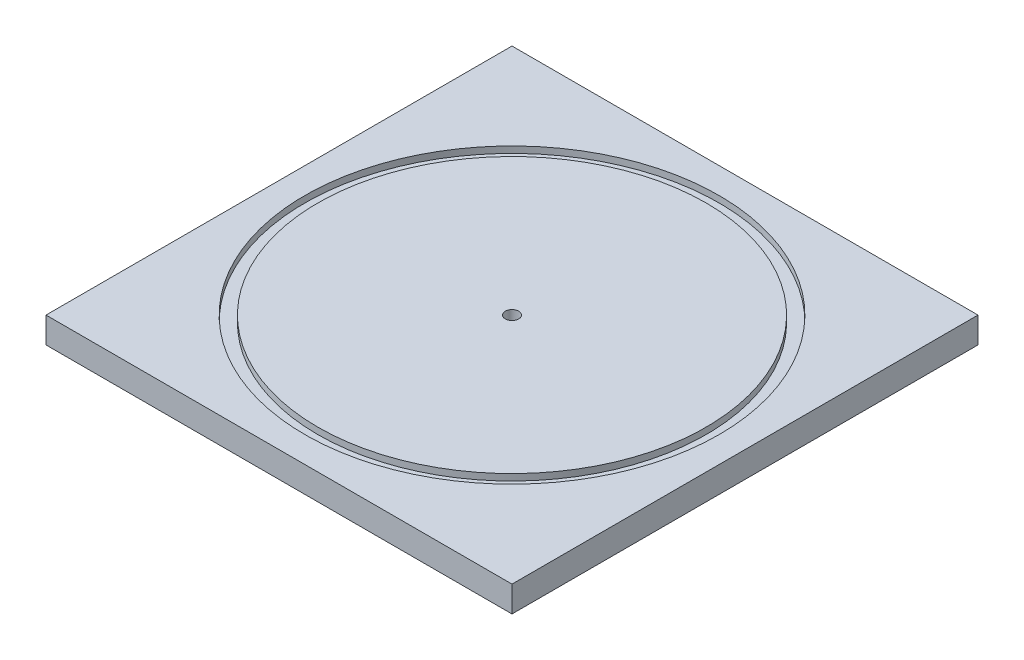
ISO-10303-21;
HEADER;
FILE_DESCRIPTION(('STEP AP214'),'2;1');
FILE_NAME('part.step','',(''),(''),'','','');
FILE_SCHEMA(('AUTOMOTIVE_DESIGN { 1 0 10303 214 1 1 1 1 }'));
ENDSEC;
DATA;
#1=APPLICATION_CONTEXT('core data for automotive mechanical design processes');
#2=APPLICATION_PROTOCOL_DEFINITION('international standard','automotive_design',2000,#1);
#3=PRODUCT_CONTEXT('',#1,'mechanical');
#4=PRODUCT('Part','Part','',(#3));
#5=PRODUCT_RELATED_PRODUCT_CATEGORY('part','',(#4));
#6=PRODUCT_DEFINITION_FORMATION('','',#4);
#7=PRODUCT_DEFINITION_CONTEXT('part definition',#1,'design');
#8=PRODUCT_DEFINITION('design','',#6,#7);
#9=PRODUCT_DEFINITION_SHAPE('','',#8);
#10=(LENGTH_UNIT() NAMED_UNIT(*) SI_UNIT(.MILLI.,.METRE.));
#11=(NAMED_UNIT(*) PLANE_ANGLE_UNIT() SI_UNIT($,.RADIAN.));
#12=(NAMED_UNIT(*) SI_UNIT($,.STERADIAN.) SOLID_ANGLE_UNIT());
#13=UNCERTAINTY_MEASURE_WITH_UNIT(LENGTH_MEASURE(1.E-05),#10,'distance_accuracy_value','');
#14=(GEOMETRIC_REPRESENTATION_CONTEXT(3) GLOBAL_UNCERTAINTY_ASSIGNED_CONTEXT((#13)) GLOBAL_UNIT_ASSIGNED_CONTEXT((#10,
#11,#12)) REPRESENTATION_CONTEXT('',''));
#15=CARTESIAN_POINT('',(0.,0.,0.));
#16=DIRECTION('',(0.,0.,1.));
#17=DIRECTION('',(1.,0.,0.));
#18=AXIS2_PLACEMENT_3D('',#15,#16,#17);
#19=CARTESIAN_POINT('',(-57.15,6.35,57.15));
#20=DIRECTION('',(1.,0.,0.));
#21=DIRECTION('',(0.,0.,-1.));
#22=AXIS2_PLACEMENT_3D('',#19,#20,#21);
#23=PLANE('',#22);
#24=DIRECTION('',(0.,0.,1.));
#25=VECTOR('',#24,1.);
#26=CARTESIAN_POINT('',(-57.15,0.,57.15));
#27=LINE('',#26,#25);
#28=CARTESIAN_POINT('',(-57.15,0.,-57.15));
#29=VERTEX_POINT('',#28);
#30=CARTESIAN_POINT('',(-57.15,0.,57.15));
#31=VERTEX_POINT('',#30);
#32=EDGE_CURVE('E102',#29,#31,#27,.T.);
#33=ORIENTED_EDGE('',*,*,#32,.T.);
#34=DIRECTION('',(0.,-1.,0.));
#35=VECTOR('',#34,1.);
#36=CARTESIAN_POINT('',(-57.15,6.35,57.15));
#37=LINE('',#36,#35);
#38=CARTESIAN_POINT('',(-57.15,6.35,57.15));
#39=VERTEX_POINT('',#38);
#40=EDGE_CURVE('E12',#39,#31,#37,.T.);
#41=ORIENTED_EDGE('',*,*,#40,.F.);
#42=DIRECTION('',(0.,0.,1.));
#43=VECTOR('',#42,1.);
#44=CARTESIAN_POINT('',(-57.15,6.35,57.15));
#45=LINE('',#44,#43);
#46=CARTESIAN_POINT('',(-57.15,6.35,-57.15));
#47=VERTEX_POINT('',#46);
#48=EDGE_CURVE('E90',#47,#39,#45,.T.);
#49=ORIENTED_EDGE('',*,*,#48,.F.);
#50=DIRECTION('',(0.,-1.,0.));
#51=VECTOR('',#50,1.);
#52=CARTESIAN_POINT('',(-57.15,6.35,-57.15));
#53=LINE('',#52,#51);
#54=EDGE_CURVE('E98',#47,#29,#53,.T.);
#55=ORIENTED_EDGE('',*,*,#54,.T.);
#56=EDGE_LOOP('',(#33,#41,#49,#55));
#57=FACE_BOUND('',#56,.T.);
#58=ADVANCED_FACE('F39',(#57),#23,.F.);
#59=CARTESIAN_POINT('',(57.15,6.35,57.15));
#60=DIRECTION('',(0.,0.,-1.));
#61=DIRECTION('',(-1.,0.,0.));
#62=AXIS2_PLACEMENT_3D('',#59,#60,#61);
#63=PLANE('',#62);
#64=DIRECTION('',(1.,0.,0.));
#65=VECTOR('',#64,1.);
#66=CARTESIAN_POINT('',(57.15,0.,57.15));
#67=LINE('',#66,#65);
#68=CARTESIAN_POINT('',(57.15,0.,57.15));
#69=VERTEX_POINT('',#68);
#70=EDGE_CURVE('E94',#31,#69,#67,.T.);
#71=ORIENTED_EDGE('',*,*,#70,.T.);
#72=DIRECTION('',(0.,-1.,0.));
#73=VECTOR('',#72,1.);
#74=CARTESIAN_POINT('',(57.15,6.35,57.15));
#75=LINE('',#74,#73);
#76=CARTESIAN_POINT('',(57.15,6.35,57.15));
#77=VERTEX_POINT('',#76);
#78=EDGE_CURVE('E47',#77,#69,#75,.T.);
#79=ORIENTED_EDGE('',*,*,#78,.F.);
#80=DIRECTION('',(1.,0.,0.));
#81=VECTOR('',#80,1.);
#82=CARTESIAN_POINT('',(57.15,6.35,57.15));
#83=LINE('',#82,#81);
#84=EDGE_CURVE('E85',#39,#77,#83,.T.);
#85=ORIENTED_EDGE('',*,*,#84,.F.);
#86=ORIENTED_EDGE('',*,*,#40,.T.);
#87=EDGE_LOOP('',(#71,#79,#85,#86));
#88=FACE_BOUND('',#87,.T.);
#89=ADVANCED_FACE('F93',(#88),#63,.F.);
#90=CARTESIAN_POINT('',(57.15,6.35,57.15));
#91=DIRECTION('',(-1.,0.,0.));
#92=DIRECTION('',(0.,0.,1.));
#93=AXIS2_PLACEMENT_3D('',#90,#91,#92);
#94=PLANE('',#93);
#95=DIRECTION('',(0.,0.,-1.));
#96=VECTOR('',#95,1.);
#97=CARTESIAN_POINT('',(57.15,0.,57.15));
#98=LINE('',#97,#96);
#99=CARTESIAN_POINT('',(57.15,0.,-57.15));
#100=VERTEX_POINT('',#99);
#101=EDGE_CURVE('E72',#69,#100,#98,.T.);
#102=ORIENTED_EDGE('',*,*,#101,.T.);
#103=DIRECTION('',(0.,-1.,0.));
#104=VECTOR('',#103,1.);
#105=CARTESIAN_POINT('',(57.15,6.35,-57.15));
#106=LINE('',#105,#104);
#107=CARTESIAN_POINT('',(57.15,6.35,-57.15));
#108=VERTEX_POINT('',#107);
#109=EDGE_CURVE('E95',#108,#100,#106,.T.);
#110=ORIENTED_EDGE('',*,*,#109,.F.);
#111=DIRECTION('',(0.,0.,-1.));
#112=VECTOR('',#111,1.);
#113=CARTESIAN_POINT('',(57.15,6.35,57.15));
#114=LINE('',#113,#112);
#115=EDGE_CURVE('E88',#77,#108,#114,.T.);
#116=ORIENTED_EDGE('',*,*,#115,.F.);
#117=ORIENTED_EDGE('',*,*,#78,.T.);
#118=EDGE_LOOP('',(#102,#110,#116,#117));
#119=FACE_BOUND('',#118,.T.);
#120=ADVANCED_FACE('F96',(#119),#94,.F.);
#121=CARTESIAN_POINT('',(57.15,6.35,-57.15));
#122=DIRECTION('',(0.,0.,1.));
#123=DIRECTION('',(1.,0.,0.));
#124=AXIS2_PLACEMENT_3D('',#121,#122,#123);
#125=PLANE('',#124);
#126=DIRECTION('',(-1.,0.,0.));
#127=VECTOR('',#126,1.);
#128=CARTESIAN_POINT('',(57.15,0.,-57.15));
#129=LINE('',#128,#127);
#130=EDGE_CURVE('E78',#100,#29,#129,.T.);
#131=ORIENTED_EDGE('',*,*,#130,.T.);
#132=ORIENTED_EDGE('',*,*,#54,.F.);
#133=DIRECTION('',(-1.,0.,0.));
#134=VECTOR('',#133,1.);
#135=CARTESIAN_POINT('',(57.15,6.35,-57.15));
#136=LINE('',#135,#134);
#137=EDGE_CURVE('E55',#108,#47,#136,.T.);
#138=ORIENTED_EDGE('',*,*,#137,.F.);
#139=ORIENTED_EDGE('',*,*,#109,.T.);
#140=EDGE_LOOP('',(#131,#132,#138,#139));
#141=FACE_BOUND('',#140,.T.);
#142=ADVANCED_FACE('F110',(#141),#125,.F.);
#143=CARTESIAN_POINT('',(0.,6.35,0.));
#144=DIRECTION('',(0.,1.,0.));
#145=DIRECTION('',(0.,0.,1.));
#146=AXIS2_PLACEMENT_3D('',#143,#144,#145);
#147=PLANE('',#146);
#148=CARTESIAN_POINT('',(0.,6.35,0.));
#149=DIRECTION('',(0.,1.,0.));
#150=DIRECTION('',(1.,0.,0.));
#151=AXIS2_PLACEMENT_3D('',#148,#149,#150);
#152=CIRCLE('',#151,50.8);
#153=CARTESIAN_POINT('',(50.8,6.35,0.));
#154=VERTEX_POINT('',#153);
#155=EDGE_CURVE('E116',#154,#154,#152,.T.);
#156=ORIENTED_EDGE('',*,*,#155,.F.);
#157=EDGE_LOOP('',(#156));
#158=FACE_BOUND('',#157,.T.);
#159=ORIENTED_EDGE('',*,*,#48,.T.);
#160=ORIENTED_EDGE('',*,*,#84,.T.);
#161=ORIENTED_EDGE('',*,*,#115,.T.);
#162=ORIENTED_EDGE('',*,*,#137,.T.);
#163=EDGE_LOOP('',(#159,#160,#161,#162));
#164=FACE_BOUND('',#163,.T.);
#165=ADVANCED_FACE('F86',(#158,#164),#147,.T.);
#166=CARTESIAN_POINT('',(0.,0.,0.));
#167=DIRECTION('',(0.,1.,0.));
#168=DIRECTION('',(0.,0.,1.));
#169=AXIS2_PLACEMENT_3D('',#166,#167,#168);
#170=PLANE('',#169);
#171=ORIENTED_EDGE('',*,*,#32,.F.);
#172=ORIENTED_EDGE('',*,*,#130,.F.);
#173=ORIENTED_EDGE('',*,*,#101,.F.);
#174=ORIENTED_EDGE('',*,*,#70,.F.);
#175=EDGE_LOOP('',(#171,#172,#173,#174));
#176=FACE_BOUND('',#175,.T.);
#177=ADVANCED_FACE('F113',(#176),#170,.F.);
#178=CARTESIAN_POINT('',(0.,4.7625,0.));
#179=DIRECTION('',(0.,1.,0.));
#180=DIRECTION('',(0.,0.,1.));
#181=AXIS2_PLACEMENT_3D('',#178,#179,#180);
#182=CYLINDRICAL_SURFACE('',#181,50.8);
#183=CARTESIAN_POINT('',(0.,4.7625,0.));
#184=DIRECTION('',(0.,1.,0.));
#185=DIRECTION('',(1.,0.,0.));
#186=AXIS2_PLACEMENT_3D('',#183,#184,#185);
#187=CIRCLE('',#186,50.8);
#188=CARTESIAN_POINT('',(50.8,4.7625,0.));
#189=VERTEX_POINT('',#188);
#190=EDGE_CURVE('E105',#189,#189,#187,.T.);
#191=ORIENTED_EDGE('',*,*,#190,.F.);
#192=EDGE_LOOP('',(#191));
#193=FACE_BOUND('',#192,.T.);
#194=ORIENTED_EDGE('',*,*,#155,.T.);
#195=EDGE_LOOP('',(#194));
#196=FACE_BOUND('',#195,.T.);
#197=ADVANCED_FACE('F157',(#193,#196),#182,.F.);
#198=CARTESIAN_POINT('',(0.,4.7625,0.));
#199=DIRECTION('',(0.,1.,0.));
#200=DIRECTION('',(0.,0.,1.));
#201=AXIS2_PLACEMENT_3D('',#198,#199,#200);
#202=PLANE('',#201);
#203=CARTESIAN_POINT('',(0.,4.7625,0.));
#204=DIRECTION('',(0.,1.,0.));
#205=DIRECTION('',(0.,0.,1.));
#206=AXIS2_PLACEMENT_3D('',#203,#204,#205);
#207=CIRCLE('',#206,47.625);
#208=CARTESIAN_POINT('',(0.,4.7625,47.625));
#209=VERTEX_POINT('',#208);
#210=EDGE_CURVE('E119',#209,#209,#207,.T.);
#211=ORIENTED_EDGE('',*,*,#210,.F.);
#212=EDGE_LOOP('',(#211));
#213=FACE_BOUND('',#212,.T.);
#214=ORIENTED_EDGE('',*,*,#190,.T.);
#215=EDGE_LOOP('',(#214));
#216=FACE_BOUND('',#215,.T.);
#217=ADVANCED_FACE('F150',(#213,#216),#202,.T.);
#218=CARTESIAN_POINT('',(0.,4.7625,0.));
#219=DIRECTION('',(0.,1.,0.));
#220=DIRECTION('',(0.,0.,1.));
#221=AXIS2_PLACEMENT_3D('',#218,#219,#220);
#222=CYLINDRICAL_SURFACE('',#221,47.625);
#223=ORIENTED_EDGE('',*,*,#210,.T.);
#224=EDGE_LOOP('',(#223));
#225=FACE_BOUND('',#224,.T.);
#226=CARTESIAN_POINT('',(0.,6.35,0.));
#227=DIRECTION('',(0.,1.,0.));
#228=DIRECTION('',(0.,0.,1.));
#229=AXIS2_PLACEMENT_3D('',#226,#227,#228);
#230=CIRCLE('',#229,47.625);
#231=CARTESIAN_POINT('',(0.,6.35,47.625));
#232=VERTEX_POINT('',#231);
#233=EDGE_CURVE('E122',#232,#232,#230,.T.);
#234=ORIENTED_EDGE('',*,*,#233,.F.);
#235=EDGE_LOOP('',(#234));
#236=FACE_BOUND('',#235,.T.);
#237=ADVANCED_FACE('F145',(#225,#236),#222,.T.);
#238=CARTESIAN_POINT('',(0.,6.35,0.));
#239=DIRECTION('',(0.,1.,0.));
#240=DIRECTION('',(0.,0.,1.));
#241=AXIS2_PLACEMENT_3D('',#238,#239,#240);
#242=CIRCLE('',#241,1.651);
#243=CARTESIAN_POINT('',(0.,6.35,1.651));
#244=VERTEX_POINT('',#243);
#245=EDGE_CURVE('E128',#244,#244,#242,.T.);
#246=ORIENTED_EDGE('',*,*,#245,.F.);
#247=EDGE_LOOP('',(#246));
#248=FACE_BOUND('',#247,.T.);
#249=ORIENTED_EDGE('',*,*,#233,.T.);
#250=EDGE_LOOP('',(#249));
#251=FACE_BOUND('',#250,.T.);
#252=ADVANCED_FACE('F139',(#248,#251),#147,.T.);
#253=CARTESIAN_POINT('',(0.,3.175,0.));
#254=DIRECTION('',(0.,1.,0.));
#255=DIRECTION('',(0.,0.,1.));
#256=AXIS2_PLACEMENT_3D('',#253,#254,#255);
#257=CYLINDRICAL_SURFACE('',#256,1.651);
#258=CARTESIAN_POINT('',(0.,3.175,0.));
#259=DIRECTION('',(0.,1.,0.));
#260=DIRECTION('',(0.,0.,1.));
#261=AXIS2_PLACEMENT_3D('',#258,#259,#260);
#262=CIRCLE('',#261,1.651);
#263=CARTESIAN_POINT('',(0.,3.175,1.651));
#264=VERTEX_POINT('',#263);
#265=EDGE_CURVE('E125',#264,#264,#262,.T.);
#266=ORIENTED_EDGE('',*,*,#265,.F.);
#267=EDGE_LOOP('',(#266));
#268=FACE_BOUND('',#267,.T.);
#269=ORIENTED_EDGE('',*,*,#245,.T.);
#270=EDGE_LOOP('',(#269));
#271=FACE_BOUND('',#270,.T.);
#272=ADVANCED_FACE('F136',(#268,#271),#257,.F.);
#273=CARTESIAN_POINT('',(0.,3.175,0.));
#274=DIRECTION('',(0.,1.,0.));
#275=DIRECTION('',(0.,0.,1.));
#276=AXIS2_PLACEMENT_3D('',#273,#274,#275);
#277=PLANE('',#276);
#278=ORIENTED_EDGE('',*,*,#265,.T.);
#279=EDGE_LOOP('',(#278));
#280=FACE_BOUND('',#279,.T.);
#281=ADVANCED_FACE('F134',(#280),#277,.T.);
#282=CLOSED_SHELL('',(#58,#89,#120,#142,#165,#177,#197,#217,#237,#252,#272,#281));
#283=MANIFOLD_SOLID_BREP('B2',#282);
#284=ADVANCED_BREP_SHAPE_REPRESENTATION('',(#18,#283),#14);
#285=SHAPE_DEFINITION_REPRESENTATION(#9,#284);
ENDSEC;
END-ISO-10303-21;
